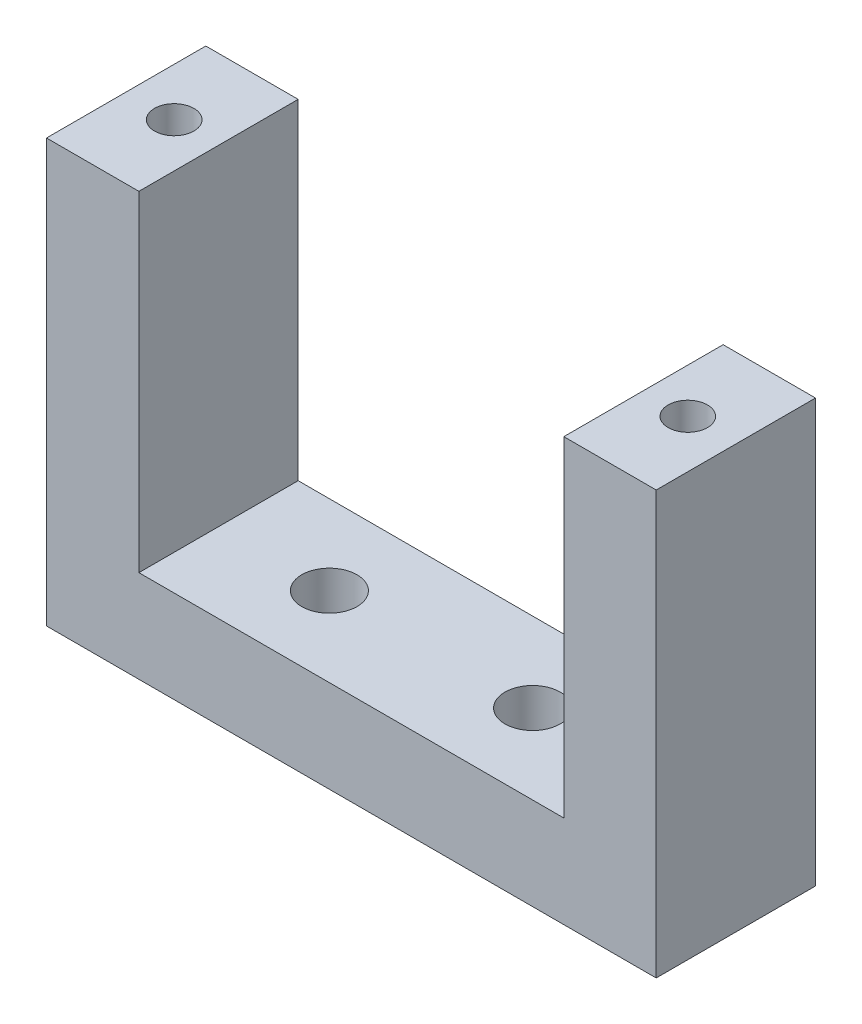
ISO-10303-21;
HEADER;
FILE_DESCRIPTION(('STEP AP214'),'2;1');
FILE_NAME('part.step','',(''),(''),'','','');
FILE_SCHEMA(('AUTOMOTIVE_DESIGN { 1 0 10303 214 1 1 1 1 }'));
ENDSEC;
DATA;
#1=APPLICATION_CONTEXT('core data for automotive mechanical design processes');
#2=APPLICATION_PROTOCOL_DEFINITION('international standard','automotive_design',2000,#1);
#3=PRODUCT_CONTEXT('',#1,'mechanical');
#4=PRODUCT('Part','Part','',(#3));
#5=PRODUCT_RELATED_PRODUCT_CATEGORY('part','',(#4));
#6=PRODUCT_DEFINITION_FORMATION('','',#4);
#7=PRODUCT_DEFINITION_CONTEXT('part definition',#1,'design');
#8=PRODUCT_DEFINITION('design','',#6,#7);
#9=PRODUCT_DEFINITION_SHAPE('','',#8);
#10=(LENGTH_UNIT() NAMED_UNIT(*) SI_UNIT(.MILLI.,.METRE.));
#11=(NAMED_UNIT(*) PLANE_ANGLE_UNIT() SI_UNIT($,.RADIAN.));
#12=(NAMED_UNIT(*) SI_UNIT($,.STERADIAN.) SOLID_ANGLE_UNIT());
#13=UNCERTAINTY_MEASURE_WITH_UNIT(LENGTH_MEASURE(1.E-05),#10,'distance_accuracy_value','');
#14=(GEOMETRIC_REPRESENTATION_CONTEXT(3) GLOBAL_UNCERTAINTY_ASSIGNED_CONTEXT((#13)) GLOBAL_UNIT_ASSIGNED_CONTEXT((#10,
#11,#12)) REPRESENTATION_CONTEXT('',''));
#15=CARTESIAN_POINT('',(0.,0.,0.));
#16=DIRECTION('',(0.,0.,1.));
#17=DIRECTION('',(1.,0.,0.));
#18=AXIS2_PLACEMENT_3D('',#15,#16,#17);
#19=CARTESIAN_POINT('',(-20.955,0.,10.95));
#20=DIRECTION('',(-1.,0.,0.));
#21=DIRECTION('',(0.,0.,1.));
#22=AXIS2_PLACEMENT_3D('',#19,#20,#21);
#23=PLANE('',#22);
#24=DIRECTION('',(0.,1.,0.));
#25=VECTOR('',#24,1.);
#26=CARTESIAN_POINT('',(-20.955,0.,0.));
#27=LINE('',#26,#25);
#28=CARTESIAN_POINT('',(-20.955,-6.35000000000006,0.));
#29=VERTEX_POINT('',#28);
#30=CARTESIAN_POINT('',(-20.955,22.701840042,0.));
#31=VERTEX_POINT('',#30);
#32=EDGE_CURVE('E138',#29,#31,#27,.T.);
#33=ORIENTED_EDGE('',*,*,#32,.F.);
#34=DIRECTION('',(0.,0.,-1.));
#35=VECTOR('',#34,1.);
#36=CARTESIAN_POINT('',(-20.955,-6.35000000000006,10.95));
#37=LINE('',#36,#35);
#38=CARTESIAN_POINT('',(-20.955,-6.35000000000006,10.95));
#39=VERTEX_POINT('',#38);
#40=EDGE_CURVE('E11',#39,#29,#37,.T.);
#41=ORIENTED_EDGE('',*,*,#40,.F.);
#42=DIRECTION('',(0.,1.,0.));
#43=VECTOR('',#42,1.);
#44=CARTESIAN_POINT('',(-20.955,0.,10.95));
#45=LINE('',#44,#43);
#46=CARTESIAN_POINT('',(-20.955,22.701840042,10.95));
#47=VERTEX_POINT('',#46);
#48=EDGE_CURVE('E159',#39,#47,#45,.T.);
#49=ORIENTED_EDGE('',*,*,#48,.T.);
#50=DIRECTION('',(0.,0.,-1.));
#51=VECTOR('',#50,1.);
#52=CARTESIAN_POINT('',(-20.955,22.701840042,10.95));
#53=LINE('',#52,#51);
#54=EDGE_CURVE('E56',#47,#31,#53,.T.);
#55=ORIENTED_EDGE('',*,*,#54,.T.);
#56=EDGE_LOOP('',(#33,#41,#49,#55));
#57=FACE_BOUND('',#56,.T.);
#58=ADVANCED_FACE('F39',(#57),#23,.T.);
#59=CARTESIAN_POINT('',(0.,-6.35000000000003,10.95));
#60=DIRECTION('',(0.,-1.,0.));
#61=DIRECTION('',(1.,0.,0.));
#62=AXIS2_PLACEMENT_3D('',#59,#60,#61);
#63=PLANE('',#62);
#64=CARTESIAN_POINT('',(6.985,-6.35000000000004,5.475));
#65=DIRECTION('',(0.,-1.,0.));
#66=DIRECTION('',(0.,0.,-1.));
#67=AXIS2_PLACEMENT_3D('',#64,#65,#66);
#68=CIRCLE('',#67,1.89864999999999);
#69=CARTESIAN_POINT('',(6.985,-6.35000000000004,3.57635000000002));
#70=VERTEX_POINT('',#69);
#71=EDGE_CURVE('E195',#70,#70,#68,.T.);
#72=ORIENTED_EDGE('',*,*,#71,.F.);
#73=EDGE_LOOP('',(#72));
#74=FACE_BOUND('',#73,.T.);
#75=CARTESIAN_POINT('',(-6.98499999999999,-6.35000000000004,5.475));
#76=DIRECTION('',(0.,-1.,0.));
#77=DIRECTION('',(0.,0.,-1.));
#78=AXIS2_PLACEMENT_3D('',#75,#76,#77);
#79=CIRCLE('',#78,1.89864999999999);
#80=CARTESIAN_POINT('',(-6.98499999999999,-6.35000000000004,3.57635000000001));
#81=VERTEX_POINT('',#80);
#82=EDGE_CURVE('E192',#81,#81,#79,.T.);
#83=ORIENTED_EDGE('',*,*,#82,.F.);
#84=EDGE_LOOP('',(#83));
#85=FACE_BOUND('',#84,.T.);
#86=DIRECTION('',(-1.,0.,0.));
#87=VECTOR('',#86,1.);
#88=CARTESIAN_POINT('',(0.,-6.35000000000003,0.));
#89=LINE('',#88,#87);
#90=CARTESIAN_POINT('',(20.955,-6.35000000000001,0.));
#91=VERTEX_POINT('',#90);
#92=EDGE_CURVE('E140',#91,#29,#89,.T.);
#93=ORIENTED_EDGE('',*,*,#92,.F.);
#94=DIRECTION('',(0.,0.,-1.));
#95=VECTOR('',#94,1.);
#96=CARTESIAN_POINT('',(20.955,-6.35000000000001,10.95));
#97=LINE('',#96,#95);
#98=CARTESIAN_POINT('',(20.955,-6.35000000000001,10.95));
#99=VERTEX_POINT('',#98);
#100=EDGE_CURVE('E48',#99,#91,#97,.T.);
#101=ORIENTED_EDGE('',*,*,#100,.F.);
#102=DIRECTION('',(-1.,0.,0.));
#103=VECTOR('',#102,1.);
#104=CARTESIAN_POINT('',(0.,-6.35000000000003,10.95));
#105=LINE('',#104,#103);
#106=EDGE_CURVE('E185',#99,#39,#105,.T.);
#107=ORIENTED_EDGE('',*,*,#106,.T.);
#108=ORIENTED_EDGE('',*,*,#40,.T.);
#109=EDGE_LOOP('',(#93,#101,#107,#108));
#110=FACE_BOUND('',#109,.T.);
#111=ADVANCED_FACE('F177',(#74,#85,#110),#63,.T.);
#112=CARTESIAN_POINT('',(20.955,0.,10.95));
#113=DIRECTION('',(1.,0.,0.));
#114=DIRECTION('',(0.,1.,0.));
#115=AXIS2_PLACEMENT_3D('',#112,#113,#114);
#116=PLANE('',#115);
#117=DIRECTION('',(0.,-1.,0.));
#118=VECTOR('',#117,1.);
#119=CARTESIAN_POINT('',(20.955,0.,0.));
#120=LINE('',#119,#118);
#121=CARTESIAN_POINT('',(20.955,22.701840042,0.));
#122=VERTEX_POINT('',#121);
#123=EDGE_CURVE('E144',#122,#91,#120,.T.);
#124=ORIENTED_EDGE('',*,*,#123,.F.);
#125=DIRECTION('',(0.,0.,-1.));
#126=VECTOR('',#125,1.);
#127=CARTESIAN_POINT('',(20.955,22.701840042,10.95));
#128=LINE('',#127,#126);
#129=CARTESIAN_POINT('',(20.955,22.701840042,10.95));
#130=VERTEX_POINT('',#129);
#131=EDGE_CURVE('E165',#130,#122,#128,.T.);
#132=ORIENTED_EDGE('',*,*,#131,.F.);
#133=DIRECTION('',(0.,-1.,0.));
#134=VECTOR('',#133,1.);
#135=CARTESIAN_POINT('',(20.955,0.,10.95));
#136=LINE('',#135,#134);
#137=EDGE_CURVE('E173',#130,#99,#136,.T.);
#138=ORIENTED_EDGE('',*,*,#137,.T.);
#139=ORIENTED_EDGE('',*,*,#100,.T.);
#140=EDGE_LOOP('',(#124,#132,#138,#139));
#141=FACE_BOUND('',#140,.T.);
#142=ADVANCED_FACE('F171',(#141),#116,.T.);
#143=CARTESIAN_POINT('',(0.,22.701840042,10.95));
#144=DIRECTION('',(0.,1.,0.));
#145=DIRECTION('',(-1.,0.,0.));
#146=AXIS2_PLACEMENT_3D('',#143,#144,#145);
#147=PLANE('',#146);
#148=CARTESIAN_POINT('',(17.6529999999999,22.701840042,5.475));
#149=DIRECTION('',(0.,1.,0.));
#150=DIRECTION('',(0.,0.,1.));
#151=AXIS2_PLACEMENT_3D('',#148,#149,#150);
#152=CIRCLE('',#151,1.35254999999999);
#153=CARTESIAN_POINT('',(17.6529999999999,22.701840042,6.82754999999999));
#154=VERTEX_POINT('',#153);
#155=EDGE_CURVE('E207',#154,#154,#152,.T.);
#156=ORIENTED_EDGE('',*,*,#155,.F.);
#157=EDGE_LOOP('',(#156));
#158=FACE_BOUND('',#157,.T.);
#159=DIRECTION('',(1.,0.,0.));
#160=VECTOR('',#159,1.);
#161=CARTESIAN_POINT('',(0.,22.701840042,0.));
#162=LINE('',#161,#160);
#163=CARTESIAN_POINT('',(14.605,22.701840042,0.));
#164=VERTEX_POINT('',#163);
#165=EDGE_CURVE('E147',#164,#122,#162,.T.);
#166=ORIENTED_EDGE('',*,*,#165,.F.);
#167=DIRECTION('',(0.,0.,-1.));
#168=VECTOR('',#167,1.);
#169=CARTESIAN_POINT('',(14.605,22.701840042,10.95));
#170=LINE('',#169,#168);
#171=CARTESIAN_POINT('',(14.605,22.701840042,10.95));
#172=VERTEX_POINT('',#171);
#173=EDGE_CURVE('E163',#172,#164,#170,.T.);
#174=ORIENTED_EDGE('',*,*,#173,.F.);
#175=DIRECTION('',(1.,0.,0.));
#176=VECTOR('',#175,1.);
#177=CARTESIAN_POINT('',(0.,22.701840042,10.95));
#178=LINE('',#177,#176);
#179=EDGE_CURVE('E133',#172,#130,#178,.T.);
#180=ORIENTED_EDGE('',*,*,#179,.T.);
#181=ORIENTED_EDGE('',*,*,#131,.T.);
#182=EDGE_LOOP('',(#166,#174,#180,#181));
#183=FACE_BOUND('',#182,.T.);
#184=ADVANCED_FACE('F183',(#158,#183),#147,.T.);
#185=CARTESIAN_POINT('',(14.605,0.,10.95));
#186=DIRECTION('',(-1.,0.,0.));
#187=DIRECTION('',(0.,0.,1.));
#188=AXIS2_PLACEMENT_3D('',#185,#186,#187);
#189=PLANE('',#188);
#190=DIRECTION('',(0.,1.,0.));
#191=VECTOR('',#190,1.);
#192=CARTESIAN_POINT('',(14.605,0.,0.));
#193=LINE('',#192,#191);
#194=CARTESIAN_POINT('',(14.605,0.,0.));
#195=VERTEX_POINT('',#194);
#196=EDGE_CURVE('E150',#195,#164,#193,.T.);
#197=ORIENTED_EDGE('',*,*,#196,.F.);
#198=DIRECTION('',(0.,0.,-1.));
#199=VECTOR('',#198,1.);
#200=CARTESIAN_POINT('',(14.605,0.,10.95));
#201=LINE('',#200,#199);
#202=CARTESIAN_POINT('',(14.605,0.,10.95));
#203=VERTEX_POINT('',#202);
#204=EDGE_CURVE('E119',#203,#195,#201,.T.);
#205=ORIENTED_EDGE('',*,*,#204,.F.);
#206=DIRECTION('',(0.,1.,0.));
#207=VECTOR('',#206,1.);
#208=CARTESIAN_POINT('',(14.605,0.,10.95));
#209=LINE('',#208,#207);
#210=EDGE_CURVE('E131',#203,#172,#209,.T.);
#211=ORIENTED_EDGE('',*,*,#210,.T.);
#212=ORIENTED_EDGE('',*,*,#173,.T.);
#213=EDGE_LOOP('',(#197,#205,#211,#212));
#214=FACE_BOUND('',#213,.T.);
#215=ADVANCED_FACE('F214',(#214),#189,.T.);
#216=CARTESIAN_POINT('',(0.,0.,10.95));
#217=DIRECTION('',(0.,1.,0.));
#218=DIRECTION('',(0.,0.,1.));
#219=AXIS2_PLACEMENT_3D('',#216,#217,#218);
#220=PLANE('',#219);
#221=CARTESIAN_POINT('',(6.985,0.,5.475));
#222=DIRECTION('',(0.,1.,0.));
#223=DIRECTION('',(0.,0.,1.));
#224=AXIS2_PLACEMENT_3D('',#221,#222,#223);
#225=CIRCLE('',#224,1.89864999999999);
#226=CARTESIAN_POINT('',(6.985,0.,7.37364999999999));
#227=VERTEX_POINT('',#226);
#228=EDGE_CURVE('E42',#227,#227,#225,.T.);
#229=ORIENTED_EDGE('',*,*,#228,.F.);
#230=EDGE_LOOP('',(#229));
#231=FACE_BOUND('',#230,.T.);
#232=CARTESIAN_POINT('',(-6.98499999999999,0.,5.475));
#233=DIRECTION('',(0.,1.,0.));
#234=DIRECTION('',(0.,0.,1.));
#235=AXIS2_PLACEMENT_3D('',#232,#233,#234);
#236=CIRCLE('',#235,1.89864999999999);
#237=CARTESIAN_POINT('',(-6.98499999999999,0.,7.37364999999999));
#238=VERTEX_POINT('',#237);
#239=EDGE_CURVE('E141',#238,#238,#236,.T.);
#240=ORIENTED_EDGE('',*,*,#239,.F.);
#241=EDGE_LOOP('',(#240));
#242=FACE_BOUND('',#241,.T.);
#243=DIRECTION('',(1.,0.,0.));
#244=VECTOR('',#243,1.);
#245=CARTESIAN_POINT('',(0.,0.,0.));
#246=LINE('',#245,#244);
#247=CARTESIAN_POINT('',(-14.605,0.,0.));
#248=VERTEX_POINT('',#247);
#249=EDGE_CURVE('E116',#248,#195,#246,.T.);
#250=ORIENTED_EDGE('',*,*,#249,.F.);
#251=DIRECTION('',(0.,0.,-1.));
#252=VECTOR('',#251,1.);
#253=CARTESIAN_POINT('',(-14.605,0.,10.95));
#254=LINE('',#253,#252);
#255=CARTESIAN_POINT('',(-14.605,0.,10.95));
#256=VERTEX_POINT('',#255);
#257=EDGE_CURVE('E110',#256,#248,#254,.T.);
#258=ORIENTED_EDGE('',*,*,#257,.F.);
#259=DIRECTION('',(1.,0.,0.));
#260=VECTOR('',#259,1.);
#261=CARTESIAN_POINT('',(0.,0.,10.95));
#262=LINE('',#261,#260);
#263=EDGE_CURVE('E114',#256,#203,#262,.T.);
#264=ORIENTED_EDGE('',*,*,#263,.T.);
#265=ORIENTED_EDGE('',*,*,#204,.T.);
#266=EDGE_LOOP('',(#250,#258,#264,#265));
#267=FACE_BOUND('',#266,.T.);
#268=ADVANCED_FACE('F112',(#231,#242,#267),#220,.T.);
#269=CARTESIAN_POINT('',(-14.605,0.,10.95));
#270=DIRECTION('',(-1.,0.,0.));
#271=DIRECTION('',(0.,0.,1.));
#272=AXIS2_PLACEMENT_3D('',#269,#270,#271);
#273=PLANE('',#272);
#274=DIRECTION('',(0.,1.,0.));
#275=VECTOR('',#274,1.);
#276=CARTESIAN_POINT('',(-14.605,0.,0.));
#277=LINE('',#276,#275);
#278=CARTESIAN_POINT('',(-14.605,22.701840042,0.));
#279=VERTEX_POINT('',#278);
#280=EDGE_CURVE('E154',#248,#279,#277,.T.);
#281=ORIENTED_EDGE('',*,*,#280,.T.);
#282=DIRECTION('',(0.,0.,-1.));
#283=VECTOR('',#282,1.);
#284=CARTESIAN_POINT('',(-14.605,22.701840042,10.95));
#285=LINE('',#284,#283);
#286=CARTESIAN_POINT('',(-14.605,22.701840042,10.95));
#287=VERTEX_POINT('',#286);
#288=EDGE_CURVE('E83',#287,#279,#285,.T.);
#289=ORIENTED_EDGE('',*,*,#288,.F.);
#290=DIRECTION('',(0.,1.,0.));
#291=VECTOR('',#290,1.);
#292=CARTESIAN_POINT('',(-14.605,0.,10.95));
#293=LINE('',#292,#291);
#294=EDGE_CURVE('E121',#256,#287,#293,.T.);
#295=ORIENTED_EDGE('',*,*,#294,.F.);
#296=ORIENTED_EDGE('',*,*,#257,.T.);
#297=EDGE_LOOP('',(#281,#289,#295,#296));
#298=FACE_BOUND('',#297,.T.);
#299=ADVANCED_FACE('F122',(#298),#273,.F.);
#300=CARTESIAN_POINT('',(0.,22.701840042,10.95));
#301=DIRECTION('',(0.,1.,0.));
#302=DIRECTION('',(-1.,0.,0.));
#303=AXIS2_PLACEMENT_3D('',#300,#301,#302);
#304=PLANE('',#303);
#305=CARTESIAN_POINT('',(-17.6530000000001,22.701840042,5.475));
#306=DIRECTION('',(0.,1.,0.));
#307=DIRECTION('',(0.,0.,1.));
#308=AXIS2_PLACEMENT_3D('',#305,#306,#307);
#309=CIRCLE('',#308,1.35254999999999);
#310=CARTESIAN_POINT('',(-17.6530000000001,22.701840042,6.82754999999999));
#311=VERTEX_POINT('',#310);
#312=EDGE_CURVE('E201',#311,#311,#309,.T.);
#313=ORIENTED_EDGE('',*,*,#312,.F.);
#314=EDGE_LOOP('',(#313));
#315=FACE_BOUND('',#314,.T.);
#316=DIRECTION('',(1.,0.,0.));
#317=VECTOR('',#316,1.);
#318=CARTESIAN_POINT('',(0.,22.701840042,0.));
#319=LINE('',#318,#317);
#320=EDGE_CURVE('E156',#31,#279,#319,.T.);
#321=ORIENTED_EDGE('',*,*,#320,.F.);
#322=ORIENTED_EDGE('',*,*,#54,.F.);
#323=DIRECTION('',(1.,0.,0.));
#324=VECTOR('',#323,1.);
#325=CARTESIAN_POINT('',(0.,22.701840042,10.95));
#326=LINE('',#325,#324);
#327=EDGE_CURVE('E125',#47,#287,#326,.T.);
#328=ORIENTED_EDGE('',*,*,#327,.T.);
#329=ORIENTED_EDGE('',*,*,#288,.T.);
#330=EDGE_LOOP('',(#321,#322,#328,#329));
#331=FACE_BOUND('',#330,.T.);
#332=ADVANCED_FACE('F228',(#315,#331),#304,.T.);
#333=CARTESIAN_POINT('',(0.,0.,10.95));
#334=DIRECTION('',(0.,0.,1.));
#335=DIRECTION('',(1.,0.,0.));
#336=AXIS2_PLACEMENT_3D('',#333,#334,#335);
#337=PLANE('',#336);
#338=ORIENTED_EDGE('',*,*,#48,.F.);
#339=ORIENTED_EDGE('',*,*,#106,.F.);
#340=ORIENTED_EDGE('',*,*,#137,.F.);
#341=ORIENTED_EDGE('',*,*,#179,.F.);
#342=ORIENTED_EDGE('',*,*,#210,.F.);
#343=ORIENTED_EDGE('',*,*,#263,.F.);
#344=ORIENTED_EDGE('',*,*,#294,.T.);
#345=ORIENTED_EDGE('',*,*,#327,.F.);
#346=EDGE_LOOP('',(#338,#339,#340,#341,#342,#343,#344,#345));
#347=FACE_BOUND('',#346,.T.);
#348=ADVANCED_FACE('F128',(#347),#337,.T.);
#349=CARTESIAN_POINT('',(0.,0.,0.));
#350=DIRECTION('',(0.,0.,1.));
#351=DIRECTION('',(1.,0.,0.));
#352=AXIS2_PLACEMENT_3D('',#349,#350,#351);
#353=PLANE('',#352);
#354=ORIENTED_EDGE('',*,*,#32,.T.);
#355=ORIENTED_EDGE('',*,*,#320,.T.);
#356=ORIENTED_EDGE('',*,*,#280,.F.);
#357=ORIENTED_EDGE('',*,*,#249,.T.);
#358=ORIENTED_EDGE('',*,*,#196,.T.);
#359=ORIENTED_EDGE('',*,*,#165,.T.);
#360=ORIENTED_EDGE('',*,*,#123,.T.);
#361=ORIENTED_EDGE('',*,*,#92,.T.);
#362=EDGE_LOOP('',(#354,#355,#356,#357,#358,#359,#360,#361));
#363=FACE_BOUND('',#362,.T.);
#364=ADVANCED_FACE('F179',(#363),#353,.F.);
#365=CARTESIAN_POINT('',(-6.98499999999999,-6.35000000000004,5.475));
#366=DIRECTION('',(0.,-1.,0.));
#367=DIRECTION('',(0.,0.,-1.));
#368=AXIS2_PLACEMENT_3D('',#365,#366,#367);
#369=CYLINDRICAL_SURFACE('',#368,1.89864999999999);
#370=ORIENTED_EDGE('',*,*,#239,.T.);
#371=EDGE_LOOP('',(#370));
#372=FACE_BOUND('',#371,.T.);
#373=ORIENTED_EDGE('',*,*,#82,.T.);
#374=EDGE_LOOP('',(#373));
#375=FACE_BOUND('',#374,.T.);
#376=ADVANCED_FACE('F250',(#372,#375),#369,.F.);
#377=CARTESIAN_POINT('',(6.985,-6.35000000000003,5.475));
#378=DIRECTION('',(0.,-1.,0.));
#379=DIRECTION('',(0.,0.,-1.));
#380=AXIS2_PLACEMENT_3D('',#377,#378,#379);
#381=CYLINDRICAL_SURFACE('',#380,1.89864999999999);
#382=ORIENTED_EDGE('',*,*,#228,.T.);
#383=EDGE_LOOP('',(#382));
#384=FACE_BOUND('',#383,.T.);
#385=ORIENTED_EDGE('',*,*,#71,.T.);
#386=EDGE_LOOP('',(#385));
#387=FACE_BOUND('',#386,.T.);
#388=ADVANCED_FACE('F253',(#384,#387),#381,.F.);
#389=CARTESIAN_POINT('',(-17.6530000000001,13.303840042,5.475));
#390=DIRECTION('',(0.,1.,0.));
#391=DIRECTION('',(0.,0.,1.));
#392=AXIS2_PLACEMENT_3D('',#389,#390,#391);
#393=CONICAL_SURFACE('',#392,1.35254999999999,1.02974425867665);
#394=CARTESIAN_POINT('',(-17.6530000000001,12.4911460117343,5.475));
#395=VERTEX_POINT('',#394);
#396=VERTEX_LOOP('',#395);
#397=FACE_BOUND('',#396,.T.);
#398=CARTESIAN_POINT('',(-17.6530000000001,13.303840042,5.475));
#399=DIRECTION('',(0.,1.,0.));
#400=DIRECTION('',(0.,0.,1.));
#401=AXIS2_PLACEMENT_3D('',#398,#399,#400);
#402=CIRCLE('',#401,1.35254999999999);
#403=CARTESIAN_POINT('',(-17.6530000000001,13.303840042,6.82754999999999));
#404=VERTEX_POINT('',#403);
#405=EDGE_CURVE('E198',#404,#404,#402,.T.);
#406=ORIENTED_EDGE('',*,*,#405,.T.);
#407=EDGE_LOOP('',(#406));
#408=FACE_BOUND('',#407,.T.);
#409=ADVANCED_FACE('F261',(#397,#408),#393,.F.);
#410=CARTESIAN_POINT('',(-17.6530000000001,22.701840042,5.475));
#411=DIRECTION('',(0.,1.,0.));
#412=DIRECTION('',(0.,0.,1.));
#413=AXIS2_PLACEMENT_3D('',#410,#411,#412);
#414=CYLINDRICAL_SURFACE('',#413,1.35254999999999);
#415=ORIENTED_EDGE('',*,*,#405,.F.);
#416=EDGE_LOOP('',(#415));
#417=FACE_BOUND('',#416,.T.);
#418=ORIENTED_EDGE('',*,*,#312,.T.);
#419=EDGE_LOOP('',(#418));
#420=FACE_BOUND('',#419,.T.);
#421=ADVANCED_FACE('F267',(#417,#420),#414,.F.);
#422=CARTESIAN_POINT('',(17.6529999999999,13.303840042,5.475));
#423=DIRECTION('',(0.,1.,0.));
#424=DIRECTION('',(0.,0.,1.));
#425=AXIS2_PLACEMENT_3D('',#422,#423,#424);
#426=CONICAL_SURFACE('',#425,1.35254999999999,1.02974425867665);
#427=CARTESIAN_POINT('',(17.6529999999999,12.4911460117343,5.475));
#428=VERTEX_POINT('',#427);
#429=VERTEX_LOOP('',#428);
#430=FACE_BOUND('',#429,.T.);
#431=CARTESIAN_POINT('',(17.6529999999999,13.303840042,5.475));
#432=DIRECTION('',(0.,1.,0.));
#433=DIRECTION('',(0.,0.,1.));
#434=AXIS2_PLACEMENT_3D('',#431,#432,#433);
#435=CIRCLE('',#434,1.35254999999999);
#436=CARTESIAN_POINT('',(17.6529999999999,13.303840042,6.82754999999999));
#437=VERTEX_POINT('',#436);
#438=EDGE_CURVE('E204',#437,#437,#435,.T.);
#439=ORIENTED_EDGE('',*,*,#438,.T.);
#440=EDGE_LOOP('',(#439));
#441=FACE_BOUND('',#440,.T.);
#442=ADVANCED_FACE('F271',(#430,#441),#426,.F.);
#443=CARTESIAN_POINT('',(17.6529999999999,22.701840042,5.475));
#444=DIRECTION('',(0.,1.,0.));
#445=DIRECTION('',(0.,0.,1.));
#446=AXIS2_PLACEMENT_3D('',#443,#444,#445);
#447=CYLINDRICAL_SURFACE('',#446,1.35254999999999);
#448=ORIENTED_EDGE('',*,*,#438,.F.);
#449=EDGE_LOOP('',(#448));
#450=FACE_BOUND('',#449,.T.);
#451=ORIENTED_EDGE('',*,*,#155,.T.);
#452=EDGE_LOOP('',(#451));
#453=FACE_BOUND('',#452,.T.);
#454=ADVANCED_FACE('F211',(#450,#453),#447,.F.);
#455=CLOSED_SHELL('',(#58,#111,#142,#184,#215,#268,#299,#332,#348,#364,#376,#388,#409,#421,#442,#454));
#456=MANIFOLD_SOLID_BREP('B2',#455);
#457=ADVANCED_BREP_SHAPE_REPRESENTATION('',(#18,#456),#14);
#458=SHAPE_DEFINITION_REPRESENTATION(#9,#457);
ENDSEC;
END-ISO-10303-21;
